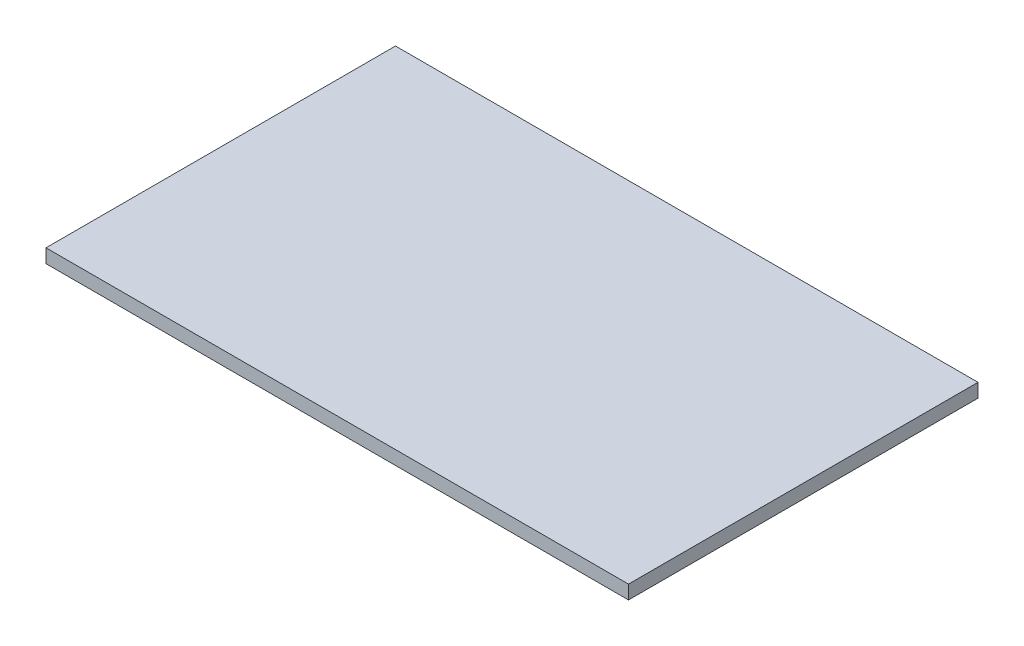
ISO-10303-21;
HEADER;
FILE_DESCRIPTION(('STEP AP214'),'2;1');
FILE_NAME('part.step','',(''),(''),'','','');
FILE_SCHEMA(('AUTOMOTIVE_DESIGN { 1 0 10303 214 1 1 1 1 }'));
ENDSEC;
DATA;
#1=APPLICATION_CONTEXT('core data for automotive mechanical design processes');
#2=APPLICATION_PROTOCOL_DEFINITION('international standard','automotive_design',2000,#1);
#3=PRODUCT_CONTEXT('',#1,'mechanical');
#4=PRODUCT('Part','Part','',(#3));
#5=PRODUCT_RELATED_PRODUCT_CATEGORY('part','',(#4));
#6=PRODUCT_DEFINITION_FORMATION('','',#4);
#7=PRODUCT_DEFINITION_CONTEXT('part definition',#1,'design');
#8=PRODUCT_DEFINITION('design','',#6,#7);
#9=PRODUCT_DEFINITION_SHAPE('','',#8);
#10=(LENGTH_UNIT() NAMED_UNIT(*) SI_UNIT(.MILLI.,.METRE.));
#11=(NAMED_UNIT(*) PLANE_ANGLE_UNIT() SI_UNIT($,.RADIAN.));
#12=(NAMED_UNIT(*) SI_UNIT($,.STERADIAN.) SOLID_ANGLE_UNIT());
#13=UNCERTAINTY_MEASURE_WITH_UNIT(LENGTH_MEASURE(1.E-05),#10,'distance_accuracy_value','');
#14=(GEOMETRIC_REPRESENTATION_CONTEXT(3) GLOBAL_UNCERTAINTY_ASSIGNED_CONTEXT((#13)) GLOBAL_UNIT_ASSIGNED_CONTEXT((#10,
#11,#12)) REPRESENTATION_CONTEXT('',''));
#15=CARTESIAN_POINT('',(0.,0.,0.));
#16=DIRECTION('',(0.,0.,1.));
#17=DIRECTION('',(1.,0.,0.));
#18=AXIS2_PLACEMENT_3D('',#15,#16,#17);
#19=CARTESIAN_POINT('',(-127.,6.,-76.2));
#20=DIRECTION('',(1.,0.,0.));
#21=DIRECTION('',(0.,0.,-1.));
#22=AXIS2_PLACEMENT_3D('',#19,#20,#21);
#23=PLANE('',#22);
#24=DIRECTION('',(0.,0.,1.));
#25=VECTOR('',#24,1.);
#26=CARTESIAN_POINT('',(-127.,0.,-76.2));
#27=LINE('',#26,#25);
#28=CARTESIAN_POINT('',(-127.,0.,-76.2));
#29=VERTEX_POINT('',#28);
#30=CARTESIAN_POINT('',(-127.,0.,76.2));
#31=VERTEX_POINT('',#30);
#32=EDGE_CURVE('E95',#29,#31,#27,.T.);
#33=ORIENTED_EDGE('',*,*,#32,.T.);
#34=DIRECTION('',(0.,-1.,0.));
#35=VECTOR('',#34,1.);
#36=CARTESIAN_POINT('',(-127.,6.,76.2));
#37=LINE('',#36,#35);
#38=CARTESIAN_POINT('',(-127.,6.,76.2));
#39=VERTEX_POINT('',#38);
#40=EDGE_CURVE('E11',#39,#31,#37,.T.);
#41=ORIENTED_EDGE('',*,*,#40,.F.);
#42=DIRECTION('',(0.,0.,1.));
#43=VECTOR('',#42,1.);
#44=CARTESIAN_POINT('',(-127.,6.,-76.2));
#45=LINE('',#44,#43);
#46=CARTESIAN_POINT('',(-127.,6.,-76.2));
#47=VERTEX_POINT('',#46);
#48=EDGE_CURVE('E81',#47,#39,#45,.T.);
#49=ORIENTED_EDGE('',*,*,#48,.F.);
#50=DIRECTION('',(0.,-1.,0.));
#51=VECTOR('',#50,1.);
#52=CARTESIAN_POINT('',(-127.,6.,-76.2));
#53=LINE('',#52,#51);
#54=EDGE_CURVE('E48',#47,#29,#53,.T.);
#55=ORIENTED_EDGE('',*,*,#54,.T.);
#56=EDGE_LOOP('',(#33,#41,#49,#55));
#57=FACE_BOUND('',#56,.T.);
#58=ADVANCED_FACE('F32',(#57),#23,.F.);
#59=CARTESIAN_POINT('',(-127.,6.,76.2));
#60=DIRECTION('',(0.,0.,-1.));
#61=DIRECTION('',(-1.,0.,0.));
#62=AXIS2_PLACEMENT_3D('',#59,#60,#61);
#63=PLANE('',#62);
#64=DIRECTION('',(1.,0.,0.));
#65=VECTOR('',#64,1.);
#66=CARTESIAN_POINT('',(-127.,0.,76.2));
#67=LINE('',#66,#65);
#68=CARTESIAN_POINT('',(127.,0.,76.2));
#69=VERTEX_POINT('',#68);
#70=EDGE_CURVE('E86',#31,#69,#67,.T.);
#71=ORIENTED_EDGE('',*,*,#70,.T.);
#72=DIRECTION('',(0.,-1.,0.));
#73=VECTOR('',#72,1.);
#74=CARTESIAN_POINT('',(127.,6.,76.2));
#75=LINE('',#74,#73);
#76=CARTESIAN_POINT('',(127.,6.,76.2));
#77=VERTEX_POINT('',#76);
#78=EDGE_CURVE('E40',#77,#69,#75,.T.);
#79=ORIENTED_EDGE('',*,*,#78,.F.);
#80=DIRECTION('',(1.,0.,0.));
#81=VECTOR('',#80,1.);
#82=CARTESIAN_POINT('',(-127.,6.,76.2));
#83=LINE('',#82,#81);
#84=EDGE_CURVE('E73',#39,#77,#83,.T.);
#85=ORIENTED_EDGE('',*,*,#84,.F.);
#86=ORIENTED_EDGE('',*,*,#40,.T.);
#87=EDGE_LOOP('',(#71,#79,#85,#86));
#88=FACE_BOUND('',#87,.T.);
#89=ADVANCED_FACE('F85',(#88),#63,.F.);
#90=CARTESIAN_POINT('',(127.,6.,-76.2));
#91=DIRECTION('',(1.,0.,0.));
#92=DIRECTION('',(0.,0.,-1.));
#93=AXIS2_PLACEMENT_3D('',#90,#91,#92);
#94=PLANE('',#93);
#95=DIRECTION('',(0.,0.,1.));
#96=VECTOR('',#95,1.);
#97=CARTESIAN_POINT('',(127.,0.,-76.2));
#98=LINE('',#97,#96);
#99=CARTESIAN_POINT('',(127.,0.,-76.2));
#100=VERTEX_POINT('',#99);
#101=EDGE_CURVE('E98',#100,#69,#98,.T.);
#102=ORIENTED_EDGE('',*,*,#101,.F.);
#103=DIRECTION('',(0.,-1.,0.));
#104=VECTOR('',#103,1.);
#105=CARTESIAN_POINT('',(127.,6.,-76.2));
#106=LINE('',#105,#104);
#107=CARTESIAN_POINT('',(127.,6.,-76.2));
#108=VERTEX_POINT('',#107);
#109=EDGE_CURVE('E62',#108,#100,#106,.T.);
#110=ORIENTED_EDGE('',*,*,#109,.F.);
#111=DIRECTION('',(0.,0.,1.));
#112=VECTOR('',#111,1.);
#113=CARTESIAN_POINT('',(127.,6.,-76.2));
#114=LINE('',#113,#112);
#115=EDGE_CURVE('E80',#108,#77,#114,.T.);
#116=ORIENTED_EDGE('',*,*,#115,.T.);
#117=ORIENTED_EDGE('',*,*,#78,.T.);
#118=EDGE_LOOP('',(#102,#110,#116,#117));
#119=FACE_BOUND('',#118,.T.);
#120=ADVANCED_FACE('F89',(#119),#94,.T.);
#121=CARTESIAN_POINT('',(-127.,6.,-76.2));
#122=DIRECTION('',(0.,0.,-1.));
#123=DIRECTION('',(-1.,0.,0.));
#124=AXIS2_PLACEMENT_3D('',#121,#122,#123);
#125=PLANE('',#124);
#126=DIRECTION('',(1.,0.,0.));
#127=VECTOR('',#126,1.);
#128=CARTESIAN_POINT('',(-127.,0.,-76.2));
#129=LINE('',#128,#127);
#130=EDGE_CURVE('E100',#29,#100,#129,.T.);
#131=ORIENTED_EDGE('',*,*,#130,.F.);
#132=ORIENTED_EDGE('',*,*,#54,.F.);
#133=DIRECTION('',(1.,0.,0.));
#134=VECTOR('',#133,1.);
#135=CARTESIAN_POINT('',(-127.,6.,-76.2));
#136=LINE('',#135,#134);
#137=EDGE_CURVE('E90',#47,#108,#136,.T.);
#138=ORIENTED_EDGE('',*,*,#137,.T.);
#139=ORIENTED_EDGE('',*,*,#109,.T.);
#140=EDGE_LOOP('',(#131,#132,#138,#139));
#141=FACE_BOUND('',#140,.T.);
#142=ADVANCED_FACE('F106',(#141),#125,.T.);
#143=CARTESIAN_POINT('',(0.,6.,0.));
#144=DIRECTION('',(0.,1.,0.));
#145=DIRECTION('',(0.,0.,1.));
#146=AXIS2_PLACEMENT_3D('',#143,#144,#145);
#147=PLANE('',#146);
#148=ORIENTED_EDGE('',*,*,#48,.T.);
#149=ORIENTED_EDGE('',*,*,#84,.T.);
#150=ORIENTED_EDGE('',*,*,#115,.F.);
#151=ORIENTED_EDGE('',*,*,#137,.F.);
#152=EDGE_LOOP('',(#148,#149,#150,#151));
#153=FACE_BOUND('',#152,.T.);
#154=ADVANCED_FACE('F77',(#153),#147,.T.);
#155=CARTESIAN_POINT('',(0.,0.,0.));
#156=DIRECTION('',(0.,1.,0.));
#157=DIRECTION('',(0.,0.,1.));
#158=AXIS2_PLACEMENT_3D('',#155,#156,#157);
#159=PLANE('',#158);
#160=ORIENTED_EDGE('',*,*,#32,.F.);
#161=ORIENTED_EDGE('',*,*,#130,.T.);
#162=ORIENTED_EDGE('',*,*,#101,.T.);
#163=ORIENTED_EDGE('',*,*,#70,.F.);
#164=EDGE_LOOP('',(#160,#161,#162,#163));
#165=FACE_BOUND('',#164,.T.);
#166=ADVANCED_FACE('F105',(#165),#159,.F.);
#167=CLOSED_SHELL('',(#58,#89,#120,#142,#154,#166));
#168=MANIFOLD_SOLID_BREP('B2',#167);
#169=ADVANCED_BREP_SHAPE_REPRESENTATION('',(#18,#168),#14);
#170=SHAPE_DEFINITION_REPRESENTATION(#9,#169);
ENDSEC;
END-ISO-10303-21;
